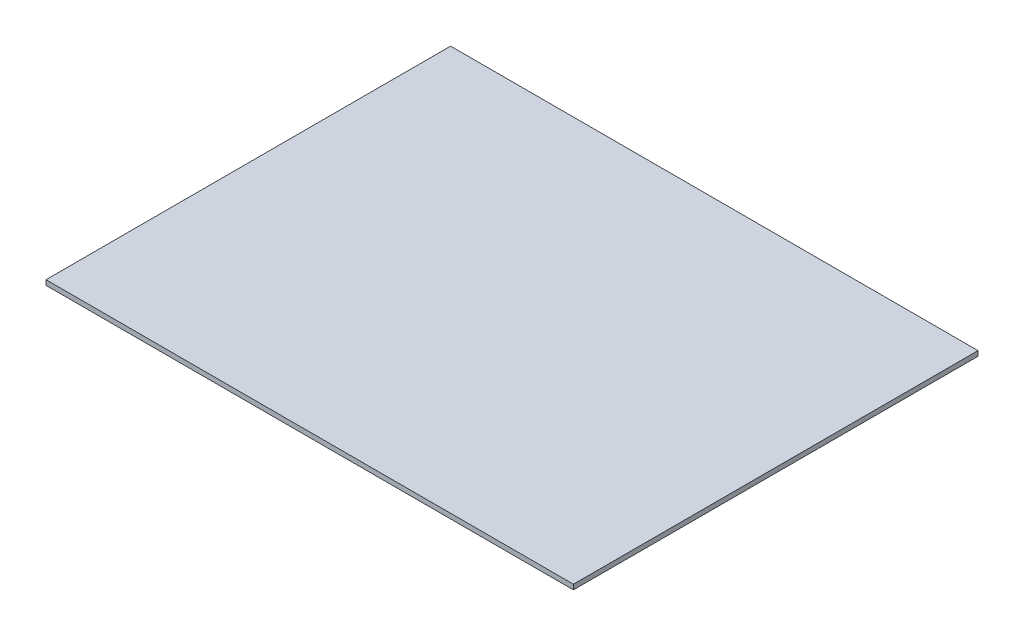
ISO-10303-21;
HEADER;
FILE_DESCRIPTION(('STEP AP214'),'2;1');
FILE_NAME('part.step','',(''),(''),'','','');
FILE_SCHEMA(('AUTOMOTIVE_DESIGN { 1 0 10303 214 1 1 1 1 }'));
ENDSEC;
DATA;
#1=APPLICATION_CONTEXT('core data for automotive mechanical design processes');
#2=APPLICATION_PROTOCOL_DEFINITION('international standard','automotive_design',2000,#1);
#3=PRODUCT_CONTEXT('',#1,'mechanical');
#4=PRODUCT('Part','Part','',(#3));
#5=PRODUCT_RELATED_PRODUCT_CATEGORY('part','',(#4));
#6=PRODUCT_DEFINITION_FORMATION('','',#4);
#7=PRODUCT_DEFINITION_CONTEXT('part definition',#1,'design');
#8=PRODUCT_DEFINITION('design','',#6,#7);
#9=PRODUCT_DEFINITION_SHAPE('','',#8);
#10=(LENGTH_UNIT() NAMED_UNIT(*) SI_UNIT(.MILLI.,.METRE.));
#11=(NAMED_UNIT(*) PLANE_ANGLE_UNIT() SI_UNIT($,.RADIAN.));
#12=(NAMED_UNIT(*) SI_UNIT($,.STERADIAN.) SOLID_ANGLE_UNIT());
#13=UNCERTAINTY_MEASURE_WITH_UNIT(LENGTH_MEASURE(1.E-05),#10,'distance_accuracy_value','');
#14=(GEOMETRIC_REPRESENTATION_CONTEXT(3) GLOBAL_UNCERTAINTY_ASSIGNED_CONTEXT((#13)) GLOBAL_UNIT_ASSIGNED_CONTEXT((#10,
#11,#12)) REPRESENTATION_CONTEXT('',''));
#15=CARTESIAN_POINT('',(0.,0.,0.));
#16=DIRECTION('',(0.,0.,1.));
#17=DIRECTION('',(1.,0.,0.));
#18=AXIS2_PLACEMENT_3D('',#15,#16,#17);
#19=CARTESIAN_POINT('',(161.,3.,-123.5));
#20=DIRECTION('',(-1.,0.,0.));
#21=DIRECTION('',(0.,0.,1.));
#22=AXIS2_PLACEMENT_3D('',#19,#20,#21);
#23=PLANE('',#22);
#24=DIRECTION('',(0.,0.,-1.));
#25=VECTOR('',#24,1.);
#26=CARTESIAN_POINT('',(161.,0.,-123.5));
#27=LINE('',#26,#25);
#28=CARTESIAN_POINT('',(161.,0.,123.5));
#29=VERTEX_POINT('',#28);
#30=CARTESIAN_POINT('',(161.,0.,-123.5));
#31=VERTEX_POINT('',#30);
#32=EDGE_CURVE('E96',#29,#31,#27,.T.);
#33=ORIENTED_EDGE('',*,*,#32,.T.);
#34=DIRECTION('',(0.,-1.,0.));
#35=VECTOR('',#34,1.);
#36=CARTESIAN_POINT('',(161.,3.,-123.5));
#37=LINE('',#36,#35);
#38=CARTESIAN_POINT('',(161.,3.,-123.5));
#39=VERTEX_POINT('',#38);
#40=EDGE_CURVE('E11',#39,#31,#37,.T.);
#41=ORIENTED_EDGE('',*,*,#40,.F.);
#42=DIRECTION('',(0.,0.,-1.));
#43=VECTOR('',#42,1.);
#44=CARTESIAN_POINT('',(161.,3.,-123.5));
#45=LINE('',#44,#43);
#46=CARTESIAN_POINT('',(161.,3.,123.5));
#47=VERTEX_POINT('',#46);
#48=EDGE_CURVE('E84',#47,#39,#45,.T.);
#49=ORIENTED_EDGE('',*,*,#48,.F.);
#50=DIRECTION('',(0.,-1.,0.));
#51=VECTOR('',#50,1.);
#52=CARTESIAN_POINT('',(161.,3.,123.5));
#53=LINE('',#52,#51);
#54=EDGE_CURVE('E92',#47,#29,#53,.T.);
#55=ORIENTED_EDGE('',*,*,#54,.T.);
#56=EDGE_LOOP('',(#33,#41,#49,#55));
#57=FACE_BOUND('',#56,.T.);
#58=ADVANCED_FACE('F33',(#57),#23,.F.);
#59=CARTESIAN_POINT('',(-161.,3.,-123.5));
#60=DIRECTION('',(0.,0.,1.));
#61=DIRECTION('',(1.,0.,0.));
#62=AXIS2_PLACEMENT_3D('',#59,#60,#61);
#63=PLANE('',#62);
#64=DIRECTION('',(-1.,0.,0.));
#65=VECTOR('',#64,1.);
#66=CARTESIAN_POINT('',(-161.,0.,-123.5));
#67=LINE('',#66,#65);
#68=CARTESIAN_POINT('',(-161.,0.,-123.5));
#69=VERTEX_POINT('',#68);
#70=EDGE_CURVE('E88',#31,#69,#67,.T.);
#71=ORIENTED_EDGE('',*,*,#70,.T.);
#72=DIRECTION('',(0.,-1.,0.));
#73=VECTOR('',#72,1.);
#74=CARTESIAN_POINT('',(-161.,3.,-123.5));
#75=LINE('',#74,#73);
#76=CARTESIAN_POINT('',(-161.,3.,-123.5));
#77=VERTEX_POINT('',#76);
#78=EDGE_CURVE('E41',#77,#69,#75,.T.);
#79=ORIENTED_EDGE('',*,*,#78,.F.);
#80=DIRECTION('',(-1.,0.,0.));
#81=VECTOR('',#80,1.);
#82=CARTESIAN_POINT('',(-161.,3.,-123.5));
#83=LINE('',#82,#81);
#84=EDGE_CURVE('E79',#39,#77,#83,.T.);
#85=ORIENTED_EDGE('',*,*,#84,.F.);
#86=ORIENTED_EDGE('',*,*,#40,.T.);
#87=EDGE_LOOP('',(#71,#79,#85,#86));
#88=FACE_BOUND('',#87,.T.);
#89=ADVANCED_FACE('F87',(#88),#63,.F.);
#90=CARTESIAN_POINT('',(-161.,3.,-123.5));
#91=DIRECTION('',(1.,0.,0.));
#92=DIRECTION('',(0.,0.,-1.));
#93=AXIS2_PLACEMENT_3D('',#90,#91,#92);
#94=PLANE('',#93);
#95=DIRECTION('',(0.,0.,1.));
#96=VECTOR('',#95,1.);
#97=CARTESIAN_POINT('',(-161.,0.,-123.5));
#98=LINE('',#97,#96);
#99=CARTESIAN_POINT('',(-161.,0.,123.5));
#100=VERTEX_POINT('',#99);
#101=EDGE_CURVE('E66',#69,#100,#98,.T.);
#102=ORIENTED_EDGE('',*,*,#101,.T.);
#103=DIRECTION('',(0.,-1.,0.));
#104=VECTOR('',#103,1.);
#105=CARTESIAN_POINT('',(-161.,3.,123.5));
#106=LINE('',#105,#104);
#107=CARTESIAN_POINT('',(-161.,3.,123.5));
#108=VERTEX_POINT('',#107);
#109=EDGE_CURVE('E89',#108,#100,#106,.T.);
#110=ORIENTED_EDGE('',*,*,#109,.F.);
#111=DIRECTION('',(0.,0.,1.));
#112=VECTOR('',#111,1.);
#113=CARTESIAN_POINT('',(-161.,3.,-123.5));
#114=LINE('',#113,#112);
#115=EDGE_CURVE('E82',#77,#108,#114,.T.);
#116=ORIENTED_EDGE('',*,*,#115,.F.);
#117=ORIENTED_EDGE('',*,*,#78,.T.);
#118=EDGE_LOOP('',(#102,#110,#116,#117));
#119=FACE_BOUND('',#118,.T.);
#120=ADVANCED_FACE('F90',(#119),#94,.F.);
#121=CARTESIAN_POINT('',(-161.,3.,123.5));
#122=DIRECTION('',(0.,0.,-1.));
#123=DIRECTION('',(-1.,0.,0.));
#124=AXIS2_PLACEMENT_3D('',#121,#122,#123);
#125=PLANE('',#124);
#126=DIRECTION('',(1.,0.,0.));
#127=VECTOR('',#126,1.);
#128=CARTESIAN_POINT('',(-161.,0.,123.5));
#129=LINE('',#128,#127);
#130=EDGE_CURVE('E72',#100,#29,#129,.T.);
#131=ORIENTED_EDGE('',*,*,#130,.T.);
#132=ORIENTED_EDGE('',*,*,#54,.F.);
#133=DIRECTION('',(1.,0.,0.));
#134=VECTOR('',#133,1.);
#135=CARTESIAN_POINT('',(-161.,3.,123.5));
#136=LINE('',#135,#134);
#137=EDGE_CURVE('E49',#108,#47,#136,.T.);
#138=ORIENTED_EDGE('',*,*,#137,.F.);
#139=ORIENTED_EDGE('',*,*,#109,.T.);
#140=EDGE_LOOP('',(#131,#132,#138,#139));
#141=FACE_BOUND('',#140,.T.);
#142=ADVANCED_FACE('F103',(#141),#125,.F.);
#143=CARTESIAN_POINT('',(0.,3.,0.));
#144=DIRECTION('',(0.,1.,0.));
#145=DIRECTION('',(0.,0.,1.));
#146=AXIS2_PLACEMENT_3D('',#143,#144,#145);
#147=PLANE('',#146);
#148=ORIENTED_EDGE('',*,*,#48,.T.);
#149=ORIENTED_EDGE('',*,*,#84,.T.);
#150=ORIENTED_EDGE('',*,*,#115,.T.);
#151=ORIENTED_EDGE('',*,*,#137,.T.);
#152=EDGE_LOOP('',(#148,#149,#150,#151));
#153=FACE_BOUND('',#152,.T.);
#154=ADVANCED_FACE('F80',(#153),#147,.T.);
#155=CARTESIAN_POINT('',(0.,0.,0.));
#156=DIRECTION('',(0.,1.,0.));
#157=DIRECTION('',(0.,0.,1.));
#158=AXIS2_PLACEMENT_3D('',#155,#156,#157);
#159=PLANE('',#158);
#160=ORIENTED_EDGE('',*,*,#32,.F.);
#161=ORIENTED_EDGE('',*,*,#130,.F.);
#162=ORIENTED_EDGE('',*,*,#101,.F.);
#163=ORIENTED_EDGE('',*,*,#70,.F.);
#164=EDGE_LOOP('',(#160,#161,#162,#163));
#165=FACE_BOUND('',#164,.T.);
#166=ADVANCED_FACE('F106',(#165),#159,.F.);
#167=CLOSED_SHELL('',(#58,#89,#120,#142,#154,#166));
#168=MANIFOLD_SOLID_BREP('B2',#167);
#169=ADVANCED_BREP_SHAPE_REPRESENTATION('',(#18,#168),#14);
#170=SHAPE_DEFINITION_REPRESENTATION(#9,#169);
ENDSEC;
END-ISO-10303-21;
